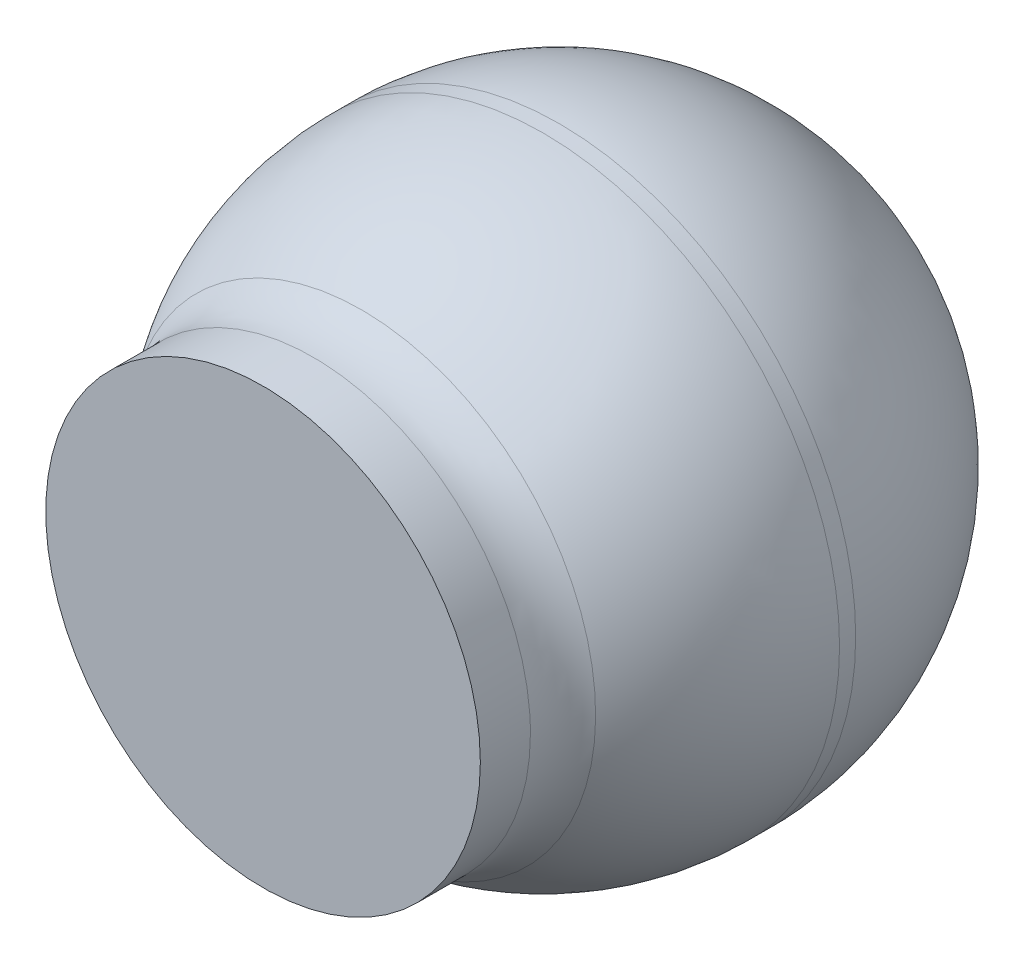
ISO-10303-21;
HEADER;
FILE_DESCRIPTION(('STEP AP214'),'2;1');
FILE_NAME('part.step','',(''),(''),'','','');
FILE_SCHEMA(('AUTOMOTIVE_DESIGN { 1 0 10303 214 1 1 1 1 }'));
ENDSEC;
DATA;
#1=APPLICATION_CONTEXT('core data for automotive mechanical design processes');
#2=APPLICATION_PROTOCOL_DEFINITION('international standard','automotive_design',2000,#1);
#3=PRODUCT_CONTEXT('',#1,'mechanical');
#4=PRODUCT('Part','Part','',(#3));
#5=PRODUCT_RELATED_PRODUCT_CATEGORY('part','',(#4));
#6=PRODUCT_DEFINITION_FORMATION('','',#4);
#7=PRODUCT_DEFINITION_CONTEXT('part definition',#1,'design');
#8=PRODUCT_DEFINITION('design','',#6,#7);
#9=PRODUCT_DEFINITION_SHAPE('','',#8);
#10=(LENGTH_UNIT() NAMED_UNIT(*) SI_UNIT(.MILLI.,.METRE.));
#11=(NAMED_UNIT(*) PLANE_ANGLE_UNIT() SI_UNIT($,.RADIAN.));
#12=(NAMED_UNIT(*) SI_UNIT($,.STERADIAN.) SOLID_ANGLE_UNIT());
#13=UNCERTAINTY_MEASURE_WITH_UNIT(LENGTH_MEASURE(1.E-05),#10,'distance_accuracy_value','');
#14=(GEOMETRIC_REPRESENTATION_CONTEXT(3) GLOBAL_UNCERTAINTY_ASSIGNED_CONTEXT((#13)) GLOBAL_UNIT_ASSIGNED_CONTEXT((#10,
#11,#12)) REPRESENTATION_CONTEXT('',''));
#15=CARTESIAN_POINT('',(0.,0.,0.));
#16=DIRECTION('',(0.,0.,1.));
#17=DIRECTION('',(1.,0.,0.));
#18=AXIS2_PLACEMENT_3D('',#15,#16,#17);
#19=CARTESIAN_POINT('',(-3.102919922269,-4.051349291452,10.006534503384));
#20=DIRECTION('',(0.,0.,-1.));
#21=DIRECTION('',(-1.,0.,0.));
#22=AXIS2_PLACEMENT_3D('',#19,#20,#21);
#23=PLANE('',#22);
#24=CARTESIAN_POINT('',(-3.102919922269,-4.051349291452,10.006534503384));
#25=DIRECTION('',(0.,0.,1.));
#26=DIRECTION('',(1.,0.,0.));
#27=AXIS2_PLACEMENT_3D('',#24,#25,#26);
#28=CIRCLE('',#27,0.275);
#29=CARTESIAN_POINT('',(-2.827919922269,-4.051349291452,10.006534503384));
#30=VERTEX_POINT('',#29);
#31=EDGE_CURVE('E20',#30,#30,#28,.F.);
#32=ORIENTED_EDGE('',*,*,#31,.F.);
#33=EDGE_LOOP('',(#32));
#34=FACE_BOUND('',#33,.T.);
#35=ADVANCED_FACE('F17',(#34),#23,.F.);
#36=CARTESIAN_POINT('',(-3.102919922269,-4.051349291452,9.906534503384));
#37=DIRECTION('',(0.,0.,1.));
#38=DIRECTION('',(1.,0.,0.));
#39=AXIS2_PLACEMENT_3D('',#36,#37,#38);
#40=CYLINDRICAL_SURFACE('',#39,0.275);
#41=CARTESIAN_POINT('',(-3.102919922269,-4.051349291452,9.943180457728));
#42=DIRECTION('',(0.,0.,-1.));
#43=DIRECTION('',(0.996700902337583,0.0811622527992439,0.));
#44=AXIS2_PLACEMENT_3D('',#41,#42,#43);
#45=CIRCLE('',#44,0.275);
#46=CARTESIAN_POINT('',(-2.82882717412616,-4.02902967193221,9.943180457728));
#47=VERTEX_POINT('',#46);
#48=EDGE_CURVE('E65',#47,#47,#45,.F.);
#49=ORIENTED_EDGE('',*,*,#48,.T.);
#50=EDGE_LOOP('',(#49));
#51=FACE_BOUND('',#50,.T.);
#52=ORIENTED_EDGE('',*,*,#31,.T.);
#53=EDGE_LOOP('',(#52));
#54=FACE_BOUND('',#53,.T.);
#55=ADVANCED_FACE('F62',(#51,#54),#40,.T.);
#56=CARTESIAN_POINT('',(-3.102919922269,-4.051349291452,9.943180457728));
#57=DIRECTION('',(0.,0.,-1.));
#58=DIRECTION('',(0.996700902337583,0.0811622527992448,0.));
#59=AXIS2_PLACEMENT_3D('',#56,#57,#58);
#60=TOROIDAL_SURFACE('',#59,0.375,0.1);
#61=ORIENTED_EDGE('',*,*,#48,.F.);
#62=EDGE_LOOP('',(#61));
#63=FACE_BOUND('',#62,.T.);
#64=CARTESIAN_POINT('',(-3.102919922269,-4.051349291452,9.881744931236));
#65=DIRECTION('',(0.,0.,-1.));
#66=DIRECTION('',(-0.996700902337598,-0.0811622527990592,0.));
#67=AXIS2_PLACEMENT_3D('',#64,#65,#66);
#68=CIRCLE('',#67,0.296097046412665);
#69=CARTESIAN_POINT('',(-3.398040115608,-4.075381194786,9.881744931236));
#70=VERTEX_POINT('',#69);
#71=EDGE_CURVE('E39',#70,#70,#68,.T.);
#72=ORIENTED_EDGE('',*,*,#71,.F.);
#73=EDGE_LOOP('',(#72));
#74=FACE_BOUND('',#73,.T.);
#75=ADVANCED_FACE('F57',(#63,#74),#60,.F.);
#76=CARTESIAN_POINT('',(-3.476682760645,-4.081785136252,9.651976062157));
#77=CARTESIAN_POINT('',(-3.476682760645,-4.081785136252,9.701461392103));
#78=CARTESIAN_POINT('',(-3.468526217348,-4.081120941579,9.750947004335));
#79=CARTESIAN_POINT('',(-3.452207085349,-4.079792059952,9.798626332798));
#80=CARTESIAN_POINT('',(-3.428341390838,-4.077848654938,9.842699544317));
#81=CARTESIAN_POINT('',(-3.398040115608,-4.075381194786,9.881744931236));
#82=(BOUNDED_CURVE() B_SPLINE_CURVE(5,(#76,#77,#78,#79,#80,#81),.UNSPECIFIED.,.F.,
.F.) B_SPLINE_CURVE_WITH_KNOTS((6,6),(0.,0.661568582165),
.UNSPECIFIED.) CURVE() GEOMETRIC_REPRESENTATION_ITEM() RATIONAL_B_SPLINE_CURVE((1.,1.,1.,1.,1.,1.)) REPRESENTATION_ITEM(''));
#83=CARTESIAN_POINT('',(-3.102919922269,-4.051349291452,9.651976062157));
#84=DIRECTION('',(0.,0.,-1.));
#85=AXIS1_PLACEMENT('',#83,#84);
#86=SURFACE_OF_REVOLUTION('',#82,#85);
#87=CARTESIAN_POINT('',(-3.102919922269,-4.051349291452,9.651976062157));
#88=DIRECTION('',(0.,0.,1.));
#89=DIRECTION('',(1.,0.,0.));
#90=AXIS2_PLACEMENT_3D('',#87,#88,#89);
#91=CIRCLE('',#90,0.375);
#92=CARTESIAN_POINT('',(-2.727919922269,-4.051349291452,9.651976062157));
#93=VERTEX_POINT('',#92);
#94=EDGE_CURVE('E36',#93,#93,#91,.F.);
#95=ORIENTED_EDGE('',*,*,#94,.F.);
#96=EDGE_LOOP('',(#95));
#97=FACE_BOUND('',#96,.T.);
#98=ORIENTED_EDGE('',*,*,#71,.T.);
#99=EDGE_LOOP('',(#98));
#100=FACE_BOUND('',#99,.T.);
#101=ADVANCED_FACE('F53',(#97,#100),#86,.F.);
#102=CARTESIAN_POINT('',(-3.102919922269,-4.051349291452,9.256534503384));
#103=DIRECTION('',(0.,0.,1.));
#104=DIRECTION('',(1.,0.,0.));
#105=AXIS2_PLACEMENT_3D('',#102,#103,#104);
#106=CYLINDRICAL_SURFACE('',#105,0.375);
#107=CARTESIAN_POINT('',(-3.102919922269,-4.051349291452,9.631534503384));
#108=DIRECTION('',(0.,0.,-1.));
#109=DIRECTION('',(0.0811622527992357,-0.996700902337583,0.));
#110=AXIS2_PLACEMENT_3D('',#107,#108,#109);
#111=CIRCLE('',#110,0.375);
#112=CARTESIAN_POINT('',(-3.07248407746929,-4.42511212982859,9.631534503384));
#113=VERTEX_POINT('',#112);
#114=CARTESIAN_POINT('',(-3.13335576706871,-3.67758645307541,9.631534503384));
#115=VERTEX_POINT('',#114);
#116=EDGE_CURVE('E11',#113,#115,#111,.T.);
#117=ORIENTED_EDGE('',*,*,#116,.F.);
#118=CARTESIAN_POINT('',(-3.102919922269,-4.051349291452,9.631534503384));
#119=DIRECTION('',(0.,0.,1.));
#120=DIRECTION('',(0.0811622527992365,-0.996700902337583,0.));
#121=AXIS2_PLACEMENT_3D('',#118,#119,#120);
#122=CIRCLE('',#121,0.375);
#123=EDGE_CURVE('E25',#115,#113,#122,.F.);
#124=ORIENTED_EDGE('',*,*,#123,.F.);
#125=EDGE_LOOP('',(#117,#124));
#126=FACE_BOUND('',#125,.T.);
#127=ORIENTED_EDGE('',*,*,#94,.T.);
#128=EDGE_LOOP('',(#127));
#129=FACE_BOUND('',#128,.T.);
#130=ADVANCED_FACE('F34',(#126,#129),#106,.T.);
#131=CARTESIAN_POINT('',(-3.102919922269,-4.051349291452,9.631534503384));
#132=DIRECTION('',(0.0811622527992361,-0.996700902337583,0.));
#133=DIRECTION('',(-0.996700902337583,-0.0811622527992361,0.));
#134=AXIS2_PLACEMENT_3D('',#131,#132,#133);
#135=SPHERICAL_SURFACE('',#134,0.375);
#136=ORIENTED_EDGE('',*,*,#123,.T.);
#137=ORIENTED_EDGE('',*,*,#116,.T.);
#138=EDGE_LOOP('',(#136,#137));
#139=FACE_BOUND('',#138,.T.);
#140=ADVANCED_FACE('F32',(#139),#135,.T.);
#141=CLOSED_SHELL('',(#35,#55,#75,#101,#130,#140));
#142=MANIFOLD_SOLID_BREP('B1',#141);
#143=ADVANCED_BREP_SHAPE_REPRESENTATION('',(#18,#142),#14);
#144=SHAPE_DEFINITION_REPRESENTATION(#9,#143);
ENDSEC;
END-ISO-10303-21;
